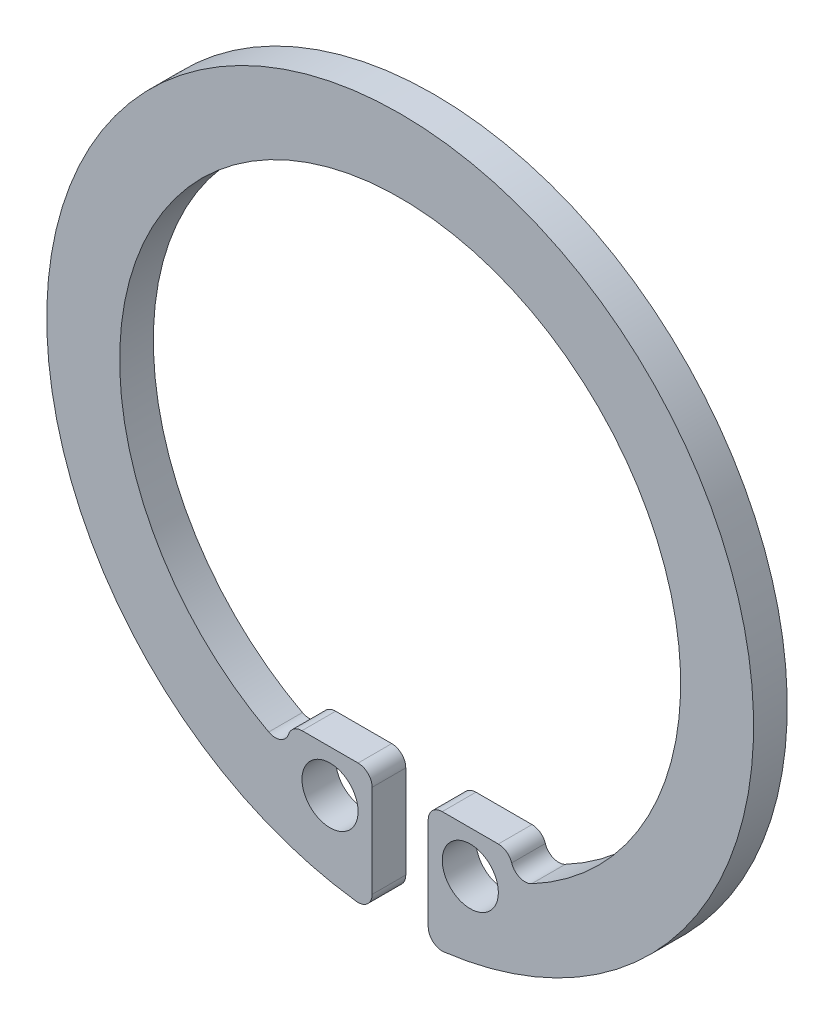
ISO-10303-21;
HEADER;
FILE_DESCRIPTION(('STEP AP214'),'2;1');
FILE_NAME('part.step','',(''),(''),'','','');
FILE_SCHEMA(('AUTOMOTIVE_DESIGN { 1 0 10303 214 1 1 1 1 }'));
ENDSEC;
DATA;
#1=APPLICATION_CONTEXT('core data for automotive mechanical design processes');
#2=APPLICATION_PROTOCOL_DEFINITION('international standard','automotive_design',2000,#1);
#3=PRODUCT_CONTEXT('',#1,'mechanical');
#4=PRODUCT('Part','Part','',(#3));
#5=PRODUCT_RELATED_PRODUCT_CATEGORY('part','',(#4));
#6=PRODUCT_DEFINITION_FORMATION('','',#4);
#7=PRODUCT_DEFINITION_CONTEXT('part definition',#1,'design');
#8=PRODUCT_DEFINITION('design','',#6,#7);
#9=PRODUCT_DEFINITION_SHAPE('','',#8);
#10=(LENGTH_UNIT() NAMED_UNIT(*) SI_UNIT(.MILLI.,.METRE.));
#11=(NAMED_UNIT(*) PLANE_ANGLE_UNIT() SI_UNIT($,.RADIAN.));
#12=(NAMED_UNIT(*) SI_UNIT($,.STERADIAN.) SOLID_ANGLE_UNIT());
#13=UNCERTAINTY_MEASURE_WITH_UNIT(LENGTH_MEASURE(1.E-05),#10,'distance_accuracy_value','');
#14=(GEOMETRIC_REPRESENTATION_CONTEXT(3) GLOBAL_UNCERTAINTY_ASSIGNED_CONTEXT((#13)) GLOBAL_UNIT_ASSIGNED_CONTEXT((#10,
#11,#12)) REPRESENTATION_CONTEXT('',''));
#15=CARTESIAN_POINT('',(0.,0.,0.));
#16=DIRECTION('',(0.,0.,1.));
#17=DIRECTION('',(1.,0.,0.));
#18=AXIS2_PLACEMENT_3D('',#15,#16,#17);
#19=CARTESIAN_POINT('',(0.,0.,1.2));
#20=DIRECTION('',(0.,0.,1.));
#21=DIRECTION('',(1.,0.,0.));
#22=AXIS2_PLACEMENT_3D('',#19,#20,#21);
#23=PLANE('',#22);
#24=CARTESIAN_POINT('',(2.5,-9.7,1.2));
#25=DIRECTION('',(0.,0.,1.));
#26=DIRECTION('',(1.,0.,0.));
#27=AXIS2_PLACEMENT_3D('',#24,#25,#26);
#28=CIRCLE('',#27,1.);
#29=CARTESIAN_POINT('',(3.5,-9.7,1.2));
#30=VERTEX_POINT('',#29);
#31=EDGE_CURVE('E242',#30,#30,#28,.T.);
#32=ORIENTED_EDGE('',*,*,#31,.F.);
#33=EDGE_LOOP('',(#32));
#34=FACE_BOUND('',#33,.T.);
#35=DIRECTION('',(0.,1.,0.));
#36=VECTOR('',#35,1.);
#37=CARTESIAN_POINT('',(-0.999999999999997,-12.5602547744861,1.2));
#38=LINE('',#37,#36);
#39=CARTESIAN_POINT('',(-0.999999999999997,-12.0066648158429,1.2));
#40=VERTEX_POINT('',#39);
#41=CARTESIAN_POINT('',(-0.999999999999998,-8.7,1.2));
#42=VERTEX_POINT('',#41);
#43=EDGE_CURVE('E153',#40,#42,#38,.T.);
#44=ORIENTED_EDGE('',*,*,#43,.T.);
#45=CARTESIAN_POINT('',(-1.5,-8.7,1.2));
#46=DIRECTION('',(0.,0.,1.));
#47=DIRECTION('',(1.,0.,0.));
#48=AXIS2_PLACEMENT_3D('',#45,#46,#47);
#49=CIRCLE('',#48,0.5);
#50=CARTESIAN_POINT('',(-1.5,-8.2,1.2));
#51=VERTEX_POINT('',#50);
#52=EDGE_CURVE('E225',#42,#51,#49,.T.);
#53=ORIENTED_EDGE('',*,*,#52,.T.);
#54=DIRECTION('',(-1.,0.,0.));
#55=VECTOR('',#54,1.);
#56=CARTESIAN_POINT('',(-0.999999999999998,-8.2,1.2));
#57=LINE('',#56,#55);
#58=CARTESIAN_POINT('',(-3.5,-8.2,1.2));
#59=VERTEX_POINT('',#58);
#60=EDGE_CURVE('E164',#51,#59,#57,.T.);
#61=ORIENTED_EDGE('',*,*,#60,.T.);
#62=CARTESIAN_POINT('',(-3.5,-8.7,1.2));
#63=DIRECTION('',(0.,0.,1.));
#64=DIRECTION('',(1.,0.,0.));
#65=AXIS2_PLACEMENT_3D('',#62,#63,#64);
#66=CIRCLE('',#65,0.5);
#67=CARTESIAN_POINT('',(-3.97577127448607,-8.54624144129871,1.2));
#68=VERTEX_POINT('',#67);
#69=EDGE_CURVE('E216',#59,#68,#66,.T.);
#70=ORIENTED_EDGE('',*,*,#69,.T.);
#71=CARTESIAN_POINT('',(-4.45154254897213,-8.39248288259742,1.2));
#72=DIRECTION('',(0.,0.,1.));
#73=DIRECTION('',(1.,0.,0.));
#74=AXIS2_PLACEMENT_3D('',#71,#72,#73);
#75=CIRCLE('',#74,0.5);
#76=CARTESIAN_POINT('',(-4.68583426207593,-8.83419250799729,1.2));
#77=VERTEX_POINT('',#76);
#78=EDGE_CURVE('E11',#68,#77,#75,.F.);
#79=ORIENTED_EDGE('',*,*,#78,.T.);
#80=CARTESIAN_POINT('',(0.,0.,1.2));
#81=DIRECTION('',(0.,0.,-1.));
#82=DIRECTION('',(1.,0.,0.));
#83=AXIS2_PLACEMENT_3D('',#80,#81,#82);
#84=CIRCLE('',#83,10.);
#85=CARTESIAN_POINT('',(4.68583426207594,-8.83419250799728,1.2));
#86=VERTEX_POINT('',#85);
#87=EDGE_CURVE('E235',#77,#86,#84,.T.);
#88=ORIENTED_EDGE('',*,*,#87,.T.);
#89=CARTESIAN_POINT('',(4.45154254897215,-8.39248288259741,1.2));
#90=DIRECTION('',(0.,0.,1.));
#91=DIRECTION('',(1.,0.,0.));
#92=AXIS2_PLACEMENT_3D('',#89,#90,#91);
#93=CIRCLE('',#92,0.5);
#94=CARTESIAN_POINT('',(3.97577127448607,-8.54624144129871,1.2));
#95=VERTEX_POINT('',#94);
#96=EDGE_CURVE('E209',#86,#95,#93,.F.);
#97=ORIENTED_EDGE('',*,*,#96,.T.);
#98=CARTESIAN_POINT('',(3.5,-8.7,1.2));
#99=DIRECTION('',(0.,0.,1.));
#100=DIRECTION('',(1.,0.,0.));
#101=AXIS2_PLACEMENT_3D('',#98,#99,#100);
#102=CIRCLE('',#101,0.5);
#103=CARTESIAN_POINT('',(3.5,-8.2,1.2));
#104=VERTEX_POINT('',#103);
#105=EDGE_CURVE('E198',#95,#104,#102,.T.);
#106=ORIENTED_EDGE('',*,*,#105,.T.);
#107=DIRECTION('',(-1.,0.,0.));
#108=VECTOR('',#107,1.);
#109=CARTESIAN_POINT('',(1.,-8.2,1.2));
#110=LINE('',#109,#108);
#111=CARTESIAN_POINT('',(1.5,-8.2,1.2));
#112=VERTEX_POINT('',#111);
#113=EDGE_CURVE('E250',#104,#112,#110,.T.);
#114=ORIENTED_EDGE('',*,*,#113,.T.);
#115=CARTESIAN_POINT('',(1.5,-8.7,1.2));
#116=DIRECTION('',(0.,0.,1.));
#117=DIRECTION('',(1.,0.,0.));
#118=AXIS2_PLACEMENT_3D('',#115,#116,#117);
#119=CIRCLE('',#118,0.5);
#120=CARTESIAN_POINT('',(1.,-8.7,1.2));
#121=VERTEX_POINT('',#120);
#122=EDGE_CURVE('E190',#112,#121,#119,.T.);
#123=ORIENTED_EDGE('',*,*,#122,.T.);
#124=DIRECTION('',(0.,-1.,0.));
#125=VECTOR('',#124,1.);
#126=CARTESIAN_POINT('',(1.,-12.5602547744861,1.2));
#127=LINE('',#126,#125);
#128=CARTESIAN_POINT('',(1.,-12.0066648158429,1.2));
#129=VERTEX_POINT('',#128);
#130=EDGE_CURVE('E248',#121,#129,#127,.T.);
#131=ORIENTED_EDGE('',*,*,#130,.T.);
#132=CARTESIAN_POINT('',(1.5,-12.0066648158429,1.2));
#133=DIRECTION('',(0.,0.,1.));
#134=DIRECTION('',(1.,0.,0.));
#135=AXIS2_PLACEMENT_3D('',#132,#133,#134);
#136=CIRCLE('',#135,0.5);
#137=CARTESIAN_POINT('',(1.56198347107438,-12.5028079900513,1.2));
#138=VERTEX_POINT('',#137);
#139=EDGE_CURVE('E171',#129,#138,#136,.T.);
#140=ORIENTED_EDGE('',*,*,#139,.T.);
#141=CARTESIAN_POINT('',(0.,0.,1.2));
#142=DIRECTION('',(0.,0.,1.));
#143=DIRECTION('',(1.,0.,0.));
#144=AXIS2_PLACEMENT_3D('',#141,#142,#143);
#145=CIRCLE('',#144,12.6);
#146=CARTESIAN_POINT('',(-1.56198347107438,-12.5028079900513,1.2));
#147=VERTEX_POINT('',#146);
#148=EDGE_CURVE('E152',#138,#147,#145,.T.);
#149=ORIENTED_EDGE('',*,*,#148,.T.);
#150=CARTESIAN_POINT('',(-1.5,-12.0066648158429,1.2));
#151=DIRECTION('',(0.,0.,1.));
#152=DIRECTION('',(1.,0.,0.));
#153=AXIS2_PLACEMENT_3D('',#150,#151,#152);
#154=CIRCLE('',#153,0.5);
#155=EDGE_CURVE('E179',#147,#40,#154,.T.);
#156=ORIENTED_EDGE('',*,*,#155,.T.);
#157=EDGE_LOOP('',(#44,#53,#61,#70,#79,#88,#97,#106,#114,#123,#131,#140,#149,#156));
#158=FACE_BOUND('',#157,.T.);
#159=CARTESIAN_POINT('',(-2.5,-9.7,1.2));
#160=DIRECTION('',(0.,0.,1.));
#161=DIRECTION('',(-1.,0.,0.));
#162=AXIS2_PLACEMENT_3D('',#159,#160,#161);
#163=CIRCLE('',#162,1.);
#164=CARTESIAN_POINT('',(-3.5,-9.7,1.2));
#165=VERTEX_POINT('',#164);
#166=EDGE_CURVE('E257',#165,#165,#163,.T.);
#167=ORIENTED_EDGE('',*,*,#166,.F.);
#168=EDGE_LOOP('',(#167));
#169=FACE_BOUND('',#168,.T.);
#170=ADVANCED_FACE('F34',(#34,#158,#169),#23,.T.);
#171=CARTESIAN_POINT('',(0.,0.,0.));
#172=DIRECTION('',(0.,0.,1.));
#173=DIRECTION('',(1.,0.,0.));
#174=AXIS2_PLACEMENT_3D('',#171,#172,#173);
#175=PLANE('',#174);
#176=DIRECTION('',(-1.,0.,0.));
#177=VECTOR('',#176,1.);
#178=CARTESIAN_POINT('',(-0.999999999999998,-8.2,0.));
#179=LINE('',#178,#177);
#180=CARTESIAN_POINT('',(-1.5,-8.2,0.));
#181=VERTEX_POINT('',#180);
#182=CARTESIAN_POINT('',(-3.5,-8.2,0.));
#183=VERTEX_POINT('',#182);
#184=EDGE_CURVE('E239',#181,#183,#179,.T.);
#185=ORIENTED_EDGE('',*,*,#184,.F.);
#186=CARTESIAN_POINT('',(-1.5,-8.7,0.));
#187=DIRECTION('',(0.,0.,1.));
#188=DIRECTION('',(1.,0.,0.));
#189=AXIS2_PLACEMENT_3D('',#186,#187,#188);
#190=CIRCLE('',#189,0.5);
#191=CARTESIAN_POINT('',(-0.999999999999998,-8.7,0.));
#192=VERTEX_POINT('',#191);
#193=EDGE_CURVE('E221',#181,#192,#190,.F.);
#194=ORIENTED_EDGE('',*,*,#193,.T.);
#195=DIRECTION('',(0.,1.,0.));
#196=VECTOR('',#195,1.);
#197=CARTESIAN_POINT('',(-0.999999999999997,-12.5602547744861,0.));
#198=LINE('',#197,#196);
#199=CARTESIAN_POINT('',(-0.999999999999997,-12.0066648158429,0.));
#200=VERTEX_POINT('',#199);
#201=EDGE_CURVE('E160',#200,#192,#198,.T.);
#202=ORIENTED_EDGE('',*,*,#201,.F.);
#203=CARTESIAN_POINT('',(-1.5,-12.0066648158429,0.));
#204=DIRECTION('',(0.,0.,1.));
#205=DIRECTION('',(1.,0.,0.));
#206=AXIS2_PLACEMENT_3D('',#203,#204,#205);
#207=CIRCLE('',#206,0.5);
#208=CARTESIAN_POINT('',(-1.56198347107438,-12.5028079900513,0.));
#209=VERTEX_POINT('',#208);
#210=EDGE_CURVE('E159',#200,#209,#207,.F.);
#211=ORIENTED_EDGE('',*,*,#210,.T.);
#212=CARTESIAN_POINT('',(0.,0.,0.));
#213=DIRECTION('',(0.,0.,1.));
#214=DIRECTION('',(1.,0.,0.));
#215=AXIS2_PLACEMENT_3D('',#212,#213,#214);
#216=CIRCLE('',#215,12.6);
#217=CARTESIAN_POINT('',(1.56198347107438,-12.5028079900513,0.));
#218=VERTEX_POINT('',#217);
#219=EDGE_CURVE('E149',#218,#209,#216,.T.);
#220=ORIENTED_EDGE('',*,*,#219,.F.);
#221=CARTESIAN_POINT('',(1.5,-12.0066648158429,0.));
#222=DIRECTION('',(0.,0.,1.));
#223=DIRECTION('',(1.,0.,0.));
#224=AXIS2_PLACEMENT_3D('',#221,#222,#223);
#225=CIRCLE('',#224,0.5);
#226=CARTESIAN_POINT('',(1.,-12.0066648158429,0.));
#227=VERTEX_POINT('',#226);
#228=EDGE_CURVE('E135',#218,#227,#225,.F.);
#229=ORIENTED_EDGE('',*,*,#228,.T.);
#230=DIRECTION('',(0.,-1.,0.));
#231=VECTOR('',#230,1.);
#232=CARTESIAN_POINT('',(1.,-12.5602547744861,0.));
#233=LINE('',#232,#231);
#234=CARTESIAN_POINT('',(1.,-8.7,0.));
#235=VERTEX_POINT('',#234);
#236=EDGE_CURVE('E161',#235,#227,#233,.T.);
#237=ORIENTED_EDGE('',*,*,#236,.F.);
#238=CARTESIAN_POINT('',(1.5,-8.7,0.));
#239=DIRECTION('',(0.,0.,1.));
#240=DIRECTION('',(1.,0.,0.));
#241=AXIS2_PLACEMENT_3D('',#238,#239,#240);
#242=CIRCLE('',#241,0.5);
#243=CARTESIAN_POINT('',(1.5,-8.2,0.));
#244=VERTEX_POINT('',#243);
#245=EDGE_CURVE('E184',#235,#244,#242,.F.);
#246=ORIENTED_EDGE('',*,*,#245,.T.);
#247=DIRECTION('',(-1.,0.,0.));
#248=VECTOR('',#247,1.);
#249=CARTESIAN_POINT('',(1.,-8.2,0.));
#250=LINE('',#249,#248);
#251=CARTESIAN_POINT('',(3.5,-8.2,0.));
#252=VERTEX_POINT('',#251);
#253=EDGE_CURVE('E166',#252,#244,#250,.T.);
#254=ORIENTED_EDGE('',*,*,#253,.F.);
#255=CARTESIAN_POINT('',(3.5,-8.7,0.));
#256=DIRECTION('',(0.,0.,1.));
#257=DIRECTION('',(1.,0.,0.));
#258=AXIS2_PLACEMENT_3D('',#255,#256,#257);
#259=CIRCLE('',#258,0.5);
#260=CARTESIAN_POINT('',(3.97577127448607,-8.54624144129871,0.));
#261=VERTEX_POINT('',#260);
#262=EDGE_CURVE('E195',#252,#261,#259,.F.);
#263=ORIENTED_EDGE('',*,*,#262,.T.);
#264=CARTESIAN_POINT('',(4.45154254897215,-8.39248288259741,0.));
#265=DIRECTION('',(0.,0.,1.));
#266=DIRECTION('',(1.,0.,0.));
#267=AXIS2_PLACEMENT_3D('',#264,#265,#266);
#268=CIRCLE('',#267,0.5);
#269=CARTESIAN_POINT('',(4.68583426207594,-8.83419250799728,0.));
#270=VERTEX_POINT('',#269);
#271=EDGE_CURVE('E206',#261,#270,#268,.T.);
#272=ORIENTED_EDGE('',*,*,#271,.T.);
#273=CARTESIAN_POINT('',(0.,0.,0.));
#274=DIRECTION('',(0.,0.,-1.));
#275=DIRECTION('',(1.,0.,0.));
#276=AXIS2_PLACEMENT_3D('',#273,#274,#275);
#277=CIRCLE('',#276,10.);
#278=CARTESIAN_POINT('',(-4.68583426207593,-8.83419250799729,0.));
#279=VERTEX_POINT('',#278);
#280=EDGE_CURVE('E234',#279,#270,#277,.T.);
#281=ORIENTED_EDGE('',*,*,#280,.F.);
#282=CARTESIAN_POINT('',(-4.45154254897213,-8.39248288259742,0.));
#283=DIRECTION('',(0.,0.,1.));
#284=DIRECTION('',(1.,0.,0.));
#285=AXIS2_PLACEMENT_3D('',#282,#283,#284);
#286=CIRCLE('',#285,0.5);
#287=CARTESIAN_POINT('',(-3.97577127448607,-8.54624144129871,0.));
#288=VERTEX_POINT('',#287);
#289=EDGE_CURVE('E42',#279,#288,#286,.T.);
#290=ORIENTED_EDGE('',*,*,#289,.T.);
#291=CARTESIAN_POINT('',(-3.5,-8.7,0.));
#292=DIRECTION('',(0.,0.,1.));
#293=DIRECTION('',(1.,0.,0.));
#294=AXIS2_PLACEMENT_3D('',#291,#292,#293);
#295=CIRCLE('',#294,0.5);
#296=EDGE_CURVE('E211',#288,#183,#295,.F.);
#297=ORIENTED_EDGE('',*,*,#296,.T.);
#298=EDGE_LOOP('',(#185,#194,#202,#211,#220,#229,#237,#246,#254,#263,#272,#281,#290,#297));
#299=FACE_BOUND('',#298,.T.);
#300=CARTESIAN_POINT('',(2.5,-9.7,0.));
#301=DIRECTION('',(0.,0.,1.));
#302=DIRECTION('',(1.,0.,0.));
#303=AXIS2_PLACEMENT_3D('',#300,#301,#302);
#304=CIRCLE('',#303,1.);
#305=CARTESIAN_POINT('',(3.5,-9.7,0.));
#306=VERTEX_POINT('',#305);
#307=EDGE_CURVE('E254',#306,#306,#304,.T.);
#308=ORIENTED_EDGE('',*,*,#307,.T.);
#309=EDGE_LOOP('',(#308));
#310=FACE_BOUND('',#309,.T.);
#311=CARTESIAN_POINT('',(-2.5,-9.7,0.));
#312=DIRECTION('',(0.,0.,1.));
#313=DIRECTION('',(-1.,0.,0.));
#314=AXIS2_PLACEMENT_3D('',#311,#312,#313);
#315=CIRCLE('',#314,1.);
#316=CARTESIAN_POINT('',(-3.5,-9.7,0.));
#317=VERTEX_POINT('',#316);
#318=EDGE_CURVE('E260',#317,#317,#315,.T.);
#319=ORIENTED_EDGE('',*,*,#318,.T.);
#320=EDGE_LOOP('',(#319));
#321=FACE_BOUND('',#320,.T.);
#322=ADVANCED_FACE('F156',(#299,#310,#321),#175,.F.);
#323=CARTESIAN_POINT('',(-0.999999999999998,-8.2,1.2));
#324=DIRECTION('',(0.,-1.,0.));
#325=DIRECTION('',(1.,0.,0.));
#326=AXIS2_PLACEMENT_3D('',#323,#324,#325);
#327=PLANE('',#326);
#328=ORIENTED_EDGE('',*,*,#60,.F.);
#329=DIRECTION('',(0.,0.,-1.));
#330=VECTOR('',#329,1.);
#331=CARTESIAN_POINT('',(-1.5,-8.2,1.2));
#332=LINE('',#331,#330);
#333=EDGE_CURVE('E218',#51,#181,#332,.T.);
#334=ORIENTED_EDGE('',*,*,#333,.T.);
#335=ORIENTED_EDGE('',*,*,#184,.T.);
#336=DIRECTION('',(0.,0.,-1.));
#337=VECTOR('',#336,1.);
#338=CARTESIAN_POINT('',(-3.5,-8.2,1.2));
#339=LINE('',#338,#337);
#340=EDGE_CURVE('E213',#183,#59,#339,.F.);
#341=ORIENTED_EDGE('',*,*,#340,.T.);
#342=EDGE_LOOP('',(#328,#334,#335,#341));
#343=FACE_BOUND('',#342,.T.);
#344=ADVANCED_FACE('F275',(#343),#327,.F.);
#345=CARTESIAN_POINT('',(0.,0.,1.2));
#346=DIRECTION('',(0.,0.,-1.));
#347=DIRECTION('',(-1.,0.,0.));
#348=AXIS2_PLACEMENT_3D('',#345,#346,#347);
#349=CYLINDRICAL_SURFACE('',#348,10.);
#350=ORIENTED_EDGE('',*,*,#87,.F.);
#351=DIRECTION('',(0.,0.,-1.));
#352=VECTOR('',#351,1.);
#353=CARTESIAN_POINT('',(-4.68583426207593,-8.83419250799729,1.2));
#354=LINE('',#353,#352);
#355=EDGE_CURVE('E227',#77,#279,#354,.T.);
#356=ORIENTED_EDGE('',*,*,#355,.T.);
#357=ORIENTED_EDGE('',*,*,#280,.T.);
#358=DIRECTION('',(0.,0.,-1.));
#359=VECTOR('',#358,1.);
#360=CARTESIAN_POINT('',(4.68583426207594,-8.83419250799728,1.2));
#361=LINE('',#360,#359);
#362=EDGE_CURVE('E203',#270,#86,#361,.F.);
#363=ORIENTED_EDGE('',*,*,#362,.T.);
#364=EDGE_LOOP('',(#350,#356,#357,#363));
#365=FACE_BOUND('',#364,.T.);
#366=ADVANCED_FACE('F233',(#365),#349,.F.);
#367=CARTESIAN_POINT('',(1.,-8.2,1.2));
#368=DIRECTION('',(0.,-1.,0.));
#369=DIRECTION('',(0.,0.,-1.));
#370=AXIS2_PLACEMENT_3D('',#367,#368,#369);
#371=PLANE('',#370);
#372=ORIENTED_EDGE('',*,*,#113,.F.);
#373=DIRECTION('',(0.,0.,-1.));
#374=VECTOR('',#373,1.);
#375=CARTESIAN_POINT('',(3.5,-8.2,1.2));
#376=LINE('',#375,#374);
#377=EDGE_CURVE('E192',#104,#252,#376,.T.);
#378=ORIENTED_EDGE('',*,*,#377,.T.);
#379=ORIENTED_EDGE('',*,*,#253,.T.);
#380=DIRECTION('',(0.,0.,-1.));
#381=VECTOR('',#380,1.);
#382=CARTESIAN_POINT('',(1.5,-8.2,1.2));
#383=LINE('',#382,#381);
#384=EDGE_CURVE('E187',#244,#112,#383,.F.);
#385=ORIENTED_EDGE('',*,*,#384,.T.);
#386=EDGE_LOOP('',(#372,#378,#379,#385));
#387=FACE_BOUND('',#386,.T.);
#388=ADVANCED_FACE('F292',(#387),#371,.F.);
#389=CARTESIAN_POINT('',(1.,-12.5602547744861,1.2));
#390=DIRECTION('',(1.,0.,0.));
#391=DIRECTION('',(0.,0.,-1.));
#392=AXIS2_PLACEMENT_3D('',#389,#390,#391);
#393=PLANE('',#392);
#394=ORIENTED_EDGE('',*,*,#130,.F.);
#395=DIRECTION('',(0.,0.,-1.));
#396=VECTOR('',#395,1.);
#397=CARTESIAN_POINT('',(1.,-8.7,1.2));
#398=LINE('',#397,#396);
#399=EDGE_CURVE('E181',#121,#235,#398,.T.);
#400=ORIENTED_EDGE('',*,*,#399,.T.);
#401=ORIENTED_EDGE('',*,*,#236,.T.);
#402=DIRECTION('',(0.,0.,-1.));
#403=VECTOR('',#402,1.);
#404=CARTESIAN_POINT('',(1.,-12.0066648158429,1.2));
#405=LINE('',#404,#403);
#406=EDGE_CURVE('E141',#227,#129,#405,.F.);
#407=ORIENTED_EDGE('',*,*,#406,.T.);
#408=EDGE_LOOP('',(#394,#400,#401,#407));
#409=FACE_BOUND('',#408,.T.);
#410=ADVANCED_FACE('F289',(#409),#393,.F.);
#411=CARTESIAN_POINT('',(0.,0.,1.2));
#412=DIRECTION('',(0.,0.,-1.));
#413=DIRECTION('',(-1.,0.,0.));
#414=AXIS2_PLACEMENT_3D('',#411,#412,#413);
#415=CYLINDRICAL_SURFACE('',#414,12.6);
#416=ORIENTED_EDGE('',*,*,#219,.T.);
#417=DIRECTION('',(0.,0.,-1.));
#418=VECTOR('',#417,1.);
#419=CARTESIAN_POINT('',(-1.56198347107438,-12.5028079900513,1.2));
#420=LINE('',#419,#418);
#421=EDGE_CURVE('E177',#209,#147,#420,.F.);
#422=ORIENTED_EDGE('',*,*,#421,.T.);
#423=ORIENTED_EDGE('',*,*,#148,.F.);
#424=DIRECTION('',(0.,0.,-1.));
#425=VECTOR('',#424,1.);
#426=CARTESIAN_POINT('',(1.56198347107438,-12.5028079900513,1.2));
#427=LINE('',#426,#425);
#428=EDGE_CURVE('E139',#138,#218,#427,.T.);
#429=ORIENTED_EDGE('',*,*,#428,.T.);
#430=EDGE_LOOP('',(#416,#422,#423,#429));
#431=FACE_BOUND('',#430,.T.);
#432=ADVANCED_FACE('F148',(#431),#415,.T.);
#433=CARTESIAN_POINT('',(-0.999999999999997,-12.5602547744861,1.2));
#434=DIRECTION('',(-1.,0.,0.));
#435=DIRECTION('',(0.,-1.,0.));
#436=AXIS2_PLACEMENT_3D('',#433,#434,#435);
#437=PLANE('',#436);
#438=ORIENTED_EDGE('',*,*,#201,.T.);
#439=DIRECTION('',(0.,0.,-1.));
#440=VECTOR('',#439,1.);
#441=CARTESIAN_POINT('',(-0.999999999999998,-8.7,1.2));
#442=LINE('',#441,#440);
#443=EDGE_CURVE('E223',#192,#42,#442,.F.);
#444=ORIENTED_EDGE('',*,*,#443,.T.);
#445=ORIENTED_EDGE('',*,*,#43,.F.);
#446=DIRECTION('',(0.,0.,-1.));
#447=VECTOR('',#446,1.);
#448=CARTESIAN_POINT('',(-0.999999999999997,-12.0066648158429,1.2));
#449=LINE('',#448,#447);
#450=EDGE_CURVE('E173',#40,#200,#449,.T.);
#451=ORIENTED_EDGE('',*,*,#450,.T.);
#452=EDGE_LOOP('',(#438,#444,#445,#451));
#453=FACE_BOUND('',#452,.T.);
#454=ADVANCED_FACE('F283',(#453),#437,.F.);
#455=CARTESIAN_POINT('',(2.5,-9.7,1.2));
#456=DIRECTION('',(0.,0.,-1.));
#457=DIRECTION('',(-1.,0.,0.));
#458=AXIS2_PLACEMENT_3D('',#455,#456,#457);
#459=CYLINDRICAL_SURFACE('',#458,1.);
#460=ORIENTED_EDGE('',*,*,#31,.T.);
#461=EDGE_LOOP('',(#460));
#462=FACE_BOUND('',#461,.T.);
#463=ORIENTED_EDGE('',*,*,#307,.F.);
#464=EDGE_LOOP('',(#463));
#465=FACE_BOUND('',#464,.T.);
#466=ADVANCED_FACE('F280',(#462,#465),#459,.F.);
#467=CARTESIAN_POINT('',(-2.5,-9.7,1.2));
#468=DIRECTION('',(0.,0.,-1.));
#469=DIRECTION('',(-1.,0.,0.));
#470=AXIS2_PLACEMENT_3D('',#467,#468,#469);
#471=CYLINDRICAL_SURFACE('',#470,1.);
#472=ORIENTED_EDGE('',*,*,#166,.T.);
#473=EDGE_LOOP('',(#472));
#474=FACE_BOUND('',#473,.T.);
#475=ORIENTED_EDGE('',*,*,#318,.F.);
#476=EDGE_LOOP('',(#475));
#477=FACE_BOUND('',#476,.T.);
#478=ADVANCED_FACE('F266',(#474,#477),#471,.F.);
#479=CARTESIAN_POINT('',(1.5,-12.0066648158429,1.2));
#480=DIRECTION('',(0.,0.,-1.));
#481=DIRECTION('',(-1.,0.,0.));
#482=AXIS2_PLACEMENT_3D('',#479,#480,#481);
#483=CYLINDRICAL_SURFACE('',#482,0.5);
#484=ORIENTED_EDGE('',*,*,#139,.F.);
#485=ORIENTED_EDGE('',*,*,#406,.F.);
#486=ORIENTED_EDGE('',*,*,#228,.F.);
#487=ORIENTED_EDGE('',*,*,#428,.F.);
#488=EDGE_LOOP('',(#484,#485,#486,#487));
#489=FACE_BOUND('',#488,.T.);
#490=ADVANCED_FACE('F138',(#489),#483,.T.);
#491=CARTESIAN_POINT('',(-1.5,-12.0066648158429,1.2));
#492=DIRECTION('',(0.,0.,-1.));
#493=DIRECTION('',(-1.,0.,0.));
#494=AXIS2_PLACEMENT_3D('',#491,#492,#493);
#495=CYLINDRICAL_SURFACE('',#494,0.5);
#496=ORIENTED_EDGE('',*,*,#155,.F.);
#497=ORIENTED_EDGE('',*,*,#421,.F.);
#498=ORIENTED_EDGE('',*,*,#210,.F.);
#499=ORIENTED_EDGE('',*,*,#450,.F.);
#500=EDGE_LOOP('',(#496,#497,#498,#499));
#501=FACE_BOUND('',#500,.T.);
#502=ADVANCED_FACE('F304',(#501),#495,.T.);
#503=CARTESIAN_POINT('',(1.5,-8.7,1.2));
#504=DIRECTION('',(0.,0.,-1.));
#505=DIRECTION('',(-1.,0.,0.));
#506=AXIS2_PLACEMENT_3D('',#503,#504,#505);
#507=CYLINDRICAL_SURFACE('',#506,0.5);
#508=ORIENTED_EDGE('',*,*,#122,.F.);
#509=ORIENTED_EDGE('',*,*,#384,.F.);
#510=ORIENTED_EDGE('',*,*,#245,.F.);
#511=ORIENTED_EDGE('',*,*,#399,.F.);
#512=EDGE_LOOP('',(#508,#509,#510,#511));
#513=FACE_BOUND('',#512,.T.);
#514=ADVANCED_FACE('F307',(#513),#507,.T.);
#515=CARTESIAN_POINT('',(3.5,-8.7,1.2));
#516=DIRECTION('',(0.,0.,-1.));
#517=DIRECTION('',(-1.,0.,0.));
#518=AXIS2_PLACEMENT_3D('',#515,#516,#517);
#519=CYLINDRICAL_SURFACE('',#518,0.5);
#520=ORIENTED_EDGE('',*,*,#105,.F.);
#521=DIRECTION('',(0.,0.,-1.));
#522=VECTOR('',#521,1.);
#523=CARTESIAN_POINT('',(3.97577127448607,-8.54624144129871,1.2));
#524=LINE('',#523,#522);
#525=EDGE_CURVE('E200',#95,#261,#524,.T.);
#526=ORIENTED_EDGE('',*,*,#525,.T.);
#527=ORIENTED_EDGE('',*,*,#262,.F.);
#528=ORIENTED_EDGE('',*,*,#377,.F.);
#529=EDGE_LOOP('',(#520,#526,#527,#528));
#530=FACE_BOUND('',#529,.T.);
#531=ADVANCED_FACE('F311',(#530),#519,.T.);
#532=CARTESIAN_POINT('',(4.45154254897215,-8.39248288259741,1.2));
#533=DIRECTION('',(0.,0.,-1.));
#534=DIRECTION('',(-1.,0.,0.));
#535=AXIS2_PLACEMENT_3D('',#532,#533,#534);
#536=CYLINDRICAL_SURFACE('',#535,0.5);
#537=ORIENTED_EDGE('',*,*,#96,.F.);
#538=ORIENTED_EDGE('',*,*,#362,.F.);
#539=ORIENTED_EDGE('',*,*,#271,.F.);
#540=ORIENTED_EDGE('',*,*,#525,.F.);
#541=EDGE_LOOP('',(#537,#538,#539,#540));
#542=FACE_BOUND('',#541,.T.);
#543=ADVANCED_FACE('F315',(#542),#536,.F.);
#544=CARTESIAN_POINT('',(-3.5,-8.7,1.2));
#545=DIRECTION('',(0.,0.,-1.));
#546=DIRECTION('',(-1.,0.,0.));
#547=AXIS2_PLACEMENT_3D('',#544,#545,#546);
#548=CYLINDRICAL_SURFACE('',#547,0.5);
#549=ORIENTED_EDGE('',*,*,#296,.F.);
#550=DIRECTION('',(0.,0.,-1.));
#551=VECTOR('',#550,1.);
#552=CARTESIAN_POINT('',(-3.97577127448607,-8.54624144129871,1.2));
#553=LINE('',#552,#551);
#554=EDGE_CURVE('E55',#288,#68,#553,.F.);
#555=ORIENTED_EDGE('',*,*,#554,.T.);
#556=ORIENTED_EDGE('',*,*,#69,.F.);
#557=ORIENTED_EDGE('',*,*,#340,.F.);
#558=EDGE_LOOP('',(#549,#555,#556,#557));
#559=FACE_BOUND('',#558,.T.);
#560=ADVANCED_FACE('F319',(#559),#548,.T.);
#561=CARTESIAN_POINT('',(-1.5,-8.7,1.2));
#562=DIRECTION('',(0.,0.,-1.));
#563=DIRECTION('',(-1.,0.,0.));
#564=AXIS2_PLACEMENT_3D('',#561,#562,#563);
#565=CYLINDRICAL_SURFACE('',#564,0.5);
#566=ORIENTED_EDGE('',*,*,#52,.F.);
#567=ORIENTED_EDGE('',*,*,#443,.F.);
#568=ORIENTED_EDGE('',*,*,#193,.F.);
#569=ORIENTED_EDGE('',*,*,#333,.F.);
#570=EDGE_LOOP('',(#566,#567,#568,#569));
#571=FACE_BOUND('',#570,.T.);
#572=ADVANCED_FACE('F322',(#571),#565,.T.);
#573=CARTESIAN_POINT('',(-4.45154254897213,-8.39248288259742,1.2));
#574=DIRECTION('',(0.,0.,-1.));
#575=DIRECTION('',(-1.,0.,0.));
#576=AXIS2_PLACEMENT_3D('',#573,#574,#575);
#577=CYLINDRICAL_SURFACE('',#576,0.5);
#578=ORIENTED_EDGE('',*,*,#78,.F.);
#579=ORIENTED_EDGE('',*,*,#554,.F.);
#580=ORIENTED_EDGE('',*,*,#289,.F.);
#581=ORIENTED_EDGE('',*,*,#355,.F.);
#582=EDGE_LOOP('',(#578,#579,#580,#581));
#583=FACE_BOUND('',#582,.T.);
#584=ADVANCED_FACE('F36',(#583),#577,.F.);
#585=CLOSED_SHELL('',(#170,#322,#344,#366,#388,#410,#432,#454,#466,#478,#490,#502,#514,#531,
#543,#560,#572,#584));
#586=MANIFOLD_SOLID_BREP('B2',#585);
#587=ADVANCED_BREP_SHAPE_REPRESENTATION('',(#18,#586),#14);
#588=SHAPE_DEFINITION_REPRESENTATION(#9,#587);
ENDSEC;
END-ISO-10303-21;
